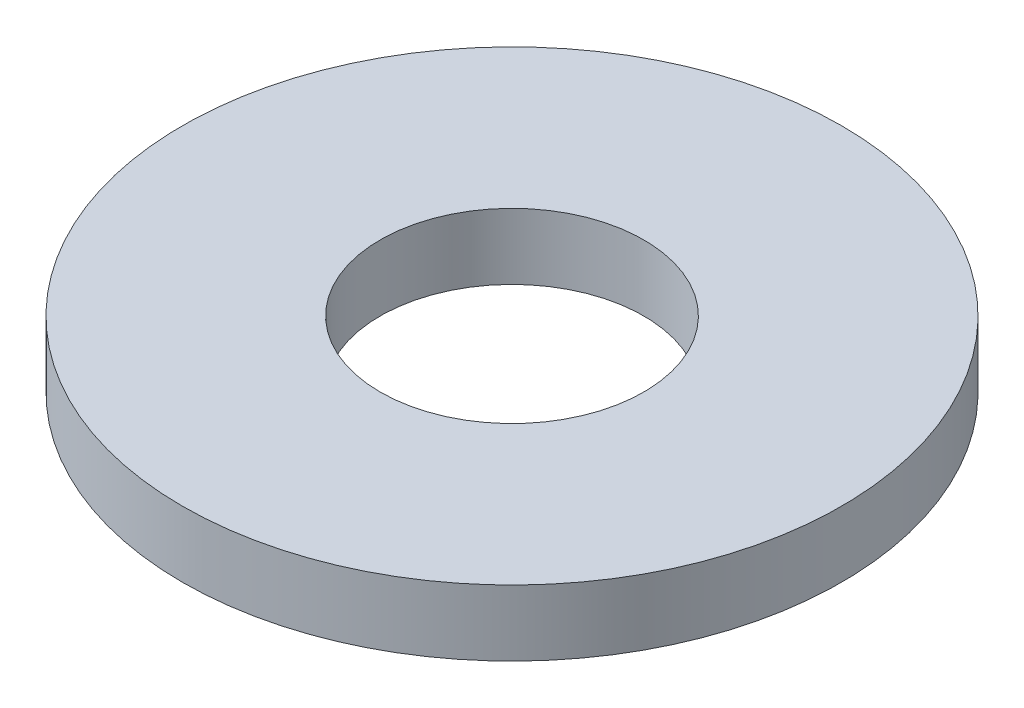
ISO-10303-21;
HEADER;
FILE_DESCRIPTION(('STEP AP214'),'2;1');
FILE_NAME('part.step','',(''),(''),'','','');
FILE_SCHEMA(('AUTOMOTIVE_DESIGN { 1 0 10303 214 1 1 1 1 }'));
ENDSEC;
DATA;
#1=APPLICATION_CONTEXT('core data for automotive mechanical design processes');
#2=APPLICATION_PROTOCOL_DEFINITION('international standard','automotive_design',2000,#1);
#3=PRODUCT_CONTEXT('',#1,'mechanical');
#4=PRODUCT('Part','Part','',(#3));
#5=PRODUCT_RELATED_PRODUCT_CATEGORY('part','',(#4));
#6=PRODUCT_DEFINITION_FORMATION('','',#4);
#7=PRODUCT_DEFINITION_CONTEXT('part definition',#1,'design');
#8=PRODUCT_DEFINITION('design','',#6,#7);
#9=PRODUCT_DEFINITION_SHAPE('','',#8);
#10=(LENGTH_UNIT() NAMED_UNIT(*) SI_UNIT(.MILLI.,.METRE.));
#11=(NAMED_UNIT(*) PLANE_ANGLE_UNIT() SI_UNIT($,.RADIAN.));
#12=(NAMED_UNIT(*) SI_UNIT($,.STERADIAN.) SOLID_ANGLE_UNIT());
#13=UNCERTAINTY_MEASURE_WITH_UNIT(LENGTH_MEASURE(1.E-05),#10,'distance_accuracy_value','');
#14=(GEOMETRIC_REPRESENTATION_CONTEXT(3) GLOBAL_UNCERTAINTY_ASSIGNED_CONTEXT((#13)) GLOBAL_UNIT_ASSIGNED_CONTEXT((#10,
#11,#12)) REPRESENTATION_CONTEXT('',''));
#15=CARTESIAN_POINT('',(0.,0.,0.));
#16=DIRECTION('',(0.,0.,1.));
#17=DIRECTION('',(1.,0.,0.));
#18=AXIS2_PLACEMENT_3D('',#15,#16,#17);
#19=CARTESIAN_POINT('',(0.,0.5,0.));
#20=DIRECTION('',(0.,1.,0.));
#21=DIRECTION('',(0.,0.,1.));
#22=AXIS2_PLACEMENT_3D('',#19,#20,#21);
#23=PLANE('',#22);
#24=CARTESIAN_POINT('',(0.,0.5,0.));
#25=DIRECTION('',(0.,1.,0.));
#26=DIRECTION('',(0.,0.,1.));
#27=AXIS2_PLACEMENT_3D('',#24,#25,#26);
#28=CIRCLE('',#27,2.5);
#29=CARTESIAN_POINT('',(0.,0.5,2.5));
#30=VERTEX_POINT('',#29);
#31=EDGE_CURVE('E10',#30,#30,#28,.T.);
#32=ORIENTED_EDGE('',*,*,#31,.T.);
#33=EDGE_LOOP('',(#32));
#34=FACE_BOUND('',#33,.T.);
#35=CARTESIAN_POINT('',(0.,0.5,0.));
#36=DIRECTION('',(0.,1.,0.));
#37=DIRECTION('',(0.,0.,1.));
#38=AXIS2_PLACEMENT_3D('',#35,#36,#37);
#39=CIRCLE('',#38,1.);
#40=CARTESIAN_POINT('',(0.,0.5,1.));
#41=VERTEX_POINT('',#40);
#42=EDGE_CURVE('E43',#41,#41,#39,.T.);
#43=ORIENTED_EDGE('',*,*,#42,.F.);
#44=EDGE_LOOP('',(#43));
#45=FACE_BOUND('',#44,.T.);
#46=ADVANCED_FACE('F32',(#34,#45),#23,.T.);
#47=CARTESIAN_POINT('',(0.,0.,0.));
#48=DIRECTION('',(0.,1.,0.));
#49=DIRECTION('',(0.,0.,1.));
#50=AXIS2_PLACEMENT_3D('',#47,#48,#49);
#51=PLANE('',#50);
#52=CARTESIAN_POINT('',(0.,0.,0.));
#53=DIRECTION('',(0.,1.,0.));
#54=DIRECTION('',(0.,0.,1.));
#55=AXIS2_PLACEMENT_3D('',#52,#53,#54);
#56=CIRCLE('',#55,2.5);
#57=CARTESIAN_POINT('',(0.,0.,2.5));
#58=VERTEX_POINT('',#57);
#59=EDGE_CURVE('E36',#58,#58,#56,.T.);
#60=ORIENTED_EDGE('',*,*,#59,.F.);
#61=EDGE_LOOP('',(#60));
#62=FACE_BOUND('',#61,.T.);
#63=CARTESIAN_POINT('',(0.,0.,0.));
#64=DIRECTION('',(0.,1.,0.));
#65=DIRECTION('',(0.,0.,1.));
#66=AXIS2_PLACEMENT_3D('',#63,#64,#65);
#67=CIRCLE('',#66,1.);
#68=CARTESIAN_POINT('',(0.,0.,1.));
#69=VERTEX_POINT('',#68);
#70=EDGE_CURVE('E45',#69,#69,#67,.T.);
#71=ORIENTED_EDGE('',*,*,#70,.T.);
#72=EDGE_LOOP('',(#71));
#73=FACE_BOUND('',#72,.T.);
#74=ADVANCED_FACE('F55',(#62,#73),#51,.F.);
#75=CARTESIAN_POINT('',(0.,0.5,0.));
#76=DIRECTION('',(0.,-1.,0.));
#77=DIRECTION('',(0.,0.,-1.));
#78=AXIS2_PLACEMENT_3D('',#75,#76,#77);
#79=CYLINDRICAL_SURFACE('',#78,2.5);
#80=ORIENTED_EDGE('',*,*,#31,.F.);
#81=EDGE_LOOP('',(#80));
#82=FACE_BOUND('',#81,.T.);
#83=ORIENTED_EDGE('',*,*,#59,.T.);
#84=EDGE_LOOP('',(#83));
#85=FACE_BOUND('',#84,.T.);
#86=ADVANCED_FACE('F34',(#82,#85),#79,.T.);
#87=CARTESIAN_POINT('',(0.,0.5,0.));
#88=DIRECTION('',(0.,-1.,0.));
#89=DIRECTION('',(0.,0.,-1.));
#90=AXIS2_PLACEMENT_3D('',#87,#88,#89);
#91=CYLINDRICAL_SURFACE('',#90,1.);
#92=ORIENTED_EDGE('',*,*,#42,.T.);
#93=EDGE_LOOP('',(#92));
#94=FACE_BOUND('',#93,.T.);
#95=ORIENTED_EDGE('',*,*,#70,.F.);
#96=EDGE_LOOP('',(#95));
#97=FACE_BOUND('',#96,.T.);
#98=ADVANCED_FACE('F51',(#94,#97),#91,.F.);
#99=CLOSED_SHELL('',(#46,#74,#86,#98));
#100=MANIFOLD_SOLID_BREP('B2',#99);
#101=ADVANCED_BREP_SHAPE_REPRESENTATION('',(#18,#100),#14);
#102=SHAPE_DEFINITION_REPRESENTATION(#9,#101);
ENDSEC;
END-ISO-10303-21;
